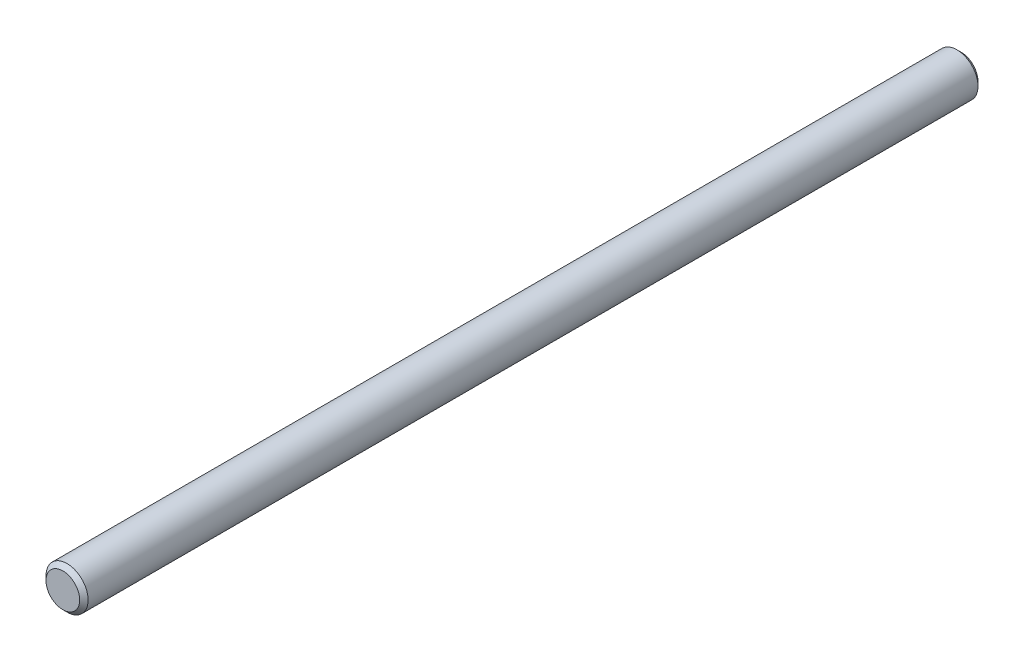
ISO-10303-21;
HEADER;
FILE_DESCRIPTION(('STEP AP214'),'2;1');
FILE_NAME('part.step','',(''),(''),'','','');
FILE_SCHEMA(('AUTOMOTIVE_DESIGN { 1 0 10303 214 1 1 1 1 }'));
ENDSEC;
DATA;
#1=APPLICATION_CONTEXT('core data for automotive mechanical design processes');
#2=APPLICATION_PROTOCOL_DEFINITION('international standard','automotive_design',2000,#1);
#3=PRODUCT_CONTEXT('',#1,'mechanical');
#4=PRODUCT('Part','Part','',(#3));
#5=PRODUCT_RELATED_PRODUCT_CATEGORY('part','',(#4));
#6=PRODUCT_DEFINITION_FORMATION('','',#4);
#7=PRODUCT_DEFINITION_CONTEXT('part definition',#1,'design');
#8=PRODUCT_DEFINITION('design','',#6,#7);
#9=PRODUCT_DEFINITION_SHAPE('','',#8);
#10=(LENGTH_UNIT() NAMED_UNIT(*) SI_UNIT(.MILLI.,.METRE.));
#11=(NAMED_UNIT(*) PLANE_ANGLE_UNIT() SI_UNIT($,.RADIAN.));
#12=(NAMED_UNIT(*) SI_UNIT($,.STERADIAN.) SOLID_ANGLE_UNIT());
#13=UNCERTAINTY_MEASURE_WITH_UNIT(LENGTH_MEASURE(1.E-05),#10,'distance_accuracy_value','');
#14=(GEOMETRIC_REPRESENTATION_CONTEXT(3) GLOBAL_UNCERTAINTY_ASSIGNED_CONTEXT((#13)) GLOBAL_UNIT_ASSIGNED_CONTEXT((#10,
#11,#12)) REPRESENTATION_CONTEXT('',''));
#15=CARTESIAN_POINT('',(0.,0.,0.));
#16=DIRECTION('',(0.,0.,1.));
#17=DIRECTION('',(1.,0.,0.));
#18=AXIS2_PLACEMENT_3D('',#15,#16,#17);
#19=CARTESIAN_POINT('',(0.,0.,50.8));
#20=DIRECTION('',(0.,0.,-1.));
#21=DIRECTION('',(-1.,0.,0.));
#22=AXIS2_PLACEMENT_3D('',#19,#20,#21);
#23=CYLINDRICAL_SURFACE('',#22,2.38125);
#24=CARTESIAN_POINT('',(0.,0.,-50.32375));
#25=DIRECTION('',(0.,0.,1.));
#26=DIRECTION('',(1.,0.,0.));
#27=AXIS2_PLACEMENT_3D('',#24,#25,#26);
#28=CIRCLE('',#27,2.38125);
#29=CARTESIAN_POINT('',(2.38125,0.,-50.32375));
#30=VERTEX_POINT('',#29);
#31=EDGE_CURVE('E43',#30,#30,#28,.T.);
#32=ORIENTED_EDGE('',*,*,#31,.T.);
#33=EDGE_LOOP('',(#32));
#34=FACE_BOUND('',#33,.T.);
#35=CARTESIAN_POINT('',(0.,0.,50.32375));
#36=DIRECTION('',(0.,0.,1.));
#37=DIRECTION('',(1.,0.,0.));
#38=AXIS2_PLACEMENT_3D('',#35,#36,#37);
#39=CIRCLE('',#38,2.38125);
#40=CARTESIAN_POINT('',(2.38125,0.,50.32375));
#41=VERTEX_POINT('',#40);
#42=EDGE_CURVE('E47',#41,#41,#39,.F.);
#43=ORIENTED_EDGE('',*,*,#42,.T.);
#44=EDGE_LOOP('',(#43));
#45=FACE_BOUND('',#44,.T.);
#46=ADVANCED_FACE('F32',(#34,#45),#23,.T.);
#47=CARTESIAN_POINT('',(0.,0.,50.8));
#48=DIRECTION('',(0.,0.,1.));
#49=DIRECTION('',(1.,0.,0.));
#50=AXIS2_PLACEMENT_3D('',#47,#48,#49);
#51=PLANE('',#50);
#52=CARTESIAN_POINT('',(0.,0.,50.8));
#53=DIRECTION('',(0.,0.,1.));
#54=DIRECTION('',(1.,0.,0.));
#55=AXIS2_PLACEMENT_3D('',#52,#53,#54);
#56=CIRCLE('',#55,1.90500000000003);
#57=CARTESIAN_POINT('',(1.90500000000003,0.,50.8));
#58=VERTEX_POINT('',#57);
#59=EDGE_CURVE('E10',#58,#58,#56,.T.);
#60=ORIENTED_EDGE('',*,*,#59,.T.);
#61=EDGE_LOOP('',(#60));
#62=FACE_BOUND('',#61,.T.);
#63=ADVANCED_FACE('F63',(#62),#51,.T.);
#64=CARTESIAN_POINT('',(0.,0.,-50.8));
#65=DIRECTION('',(0.,0.,1.));
#66=DIRECTION('',(1.,0.,0.));
#67=AXIS2_PLACEMENT_3D('',#64,#65,#66);
#68=PLANE('',#67);
#69=CARTESIAN_POINT('',(0.,0.,-50.8));
#70=DIRECTION('',(0.,0.,1.));
#71=DIRECTION('',(1.,0.,0.));
#72=AXIS2_PLACEMENT_3D('',#69,#70,#71);
#73=CIRCLE('',#72,1.90500000000002);
#74=CARTESIAN_POINT('',(1.90500000000002,0.,-50.8));
#75=VERTEX_POINT('',#74);
#76=EDGE_CURVE('E39',#75,#75,#73,.F.);
#77=ORIENTED_EDGE('',*,*,#76,.T.);
#78=EDGE_LOOP('',(#77));
#79=FACE_BOUND('',#78,.T.);
#80=ADVANCED_FACE('F60',(#79),#68,.F.);
#81=CARTESIAN_POINT('',(0.,0.,-50.32375));
#82=DIRECTION('',(0.,0.,1.));
#83=DIRECTION('',(1.,0.,0.));
#84=AXIS2_PLACEMENT_3D('',#81,#82,#83);
#85=CONICAL_SURFACE('',#84,2.38125,0.785398163397447);
#86=ORIENTED_EDGE('',*,*,#76,.F.);
#87=EDGE_LOOP('',(#86));
#88=FACE_BOUND('',#87,.T.);
#89=ORIENTED_EDGE('',*,*,#31,.F.);
#90=EDGE_LOOP('',(#89));
#91=FACE_BOUND('',#90,.T.);
#92=ADVANCED_FACE('F56',(#88,#91),#85,.T.);
#93=CARTESIAN_POINT('',(0.,0.,50.8));
#94=DIRECTION('',(0.,0.,-1.));
#95=DIRECTION('',(-1.,0.,0.));
#96=AXIS2_PLACEMENT_3D('',#93,#94,#95);
#97=CONICAL_SURFACE('',#96,1.90500000000003,0.78539816339744);
#98=ORIENTED_EDGE('',*,*,#42,.F.);
#99=EDGE_LOOP('',(#98));
#100=FACE_BOUND('',#99,.T.);
#101=ORIENTED_EDGE('',*,*,#59,.F.);
#102=EDGE_LOOP('',(#101));
#103=FACE_BOUND('',#102,.T.);
#104=ADVANCED_FACE('F34',(#100,#103),#97,.T.);
#105=CLOSED_SHELL('',(#46,#63,#80,#92,#104));
#106=MANIFOLD_SOLID_BREP('B2',#105);
#107=ADVANCED_BREP_SHAPE_REPRESENTATION('',(#18,#106),#14);
#108=SHAPE_DEFINITION_REPRESENTATION(#9,#107);
ENDSEC;
END-ISO-10303-21;
